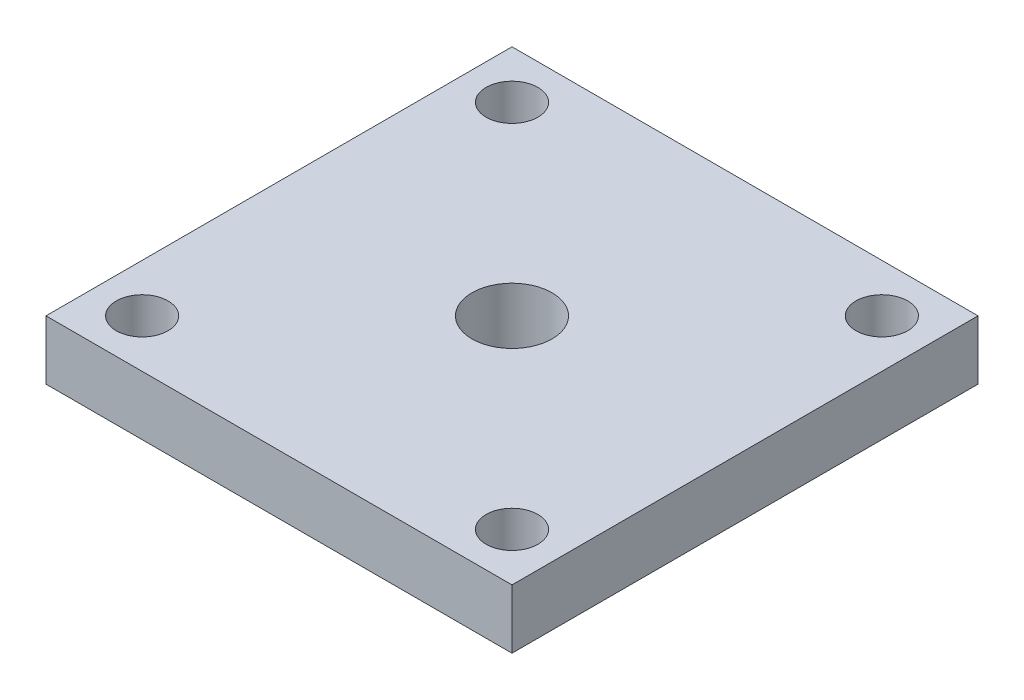
ISO-10303-21;
HEADER;
FILE_DESCRIPTION(('STEP AP214'),'2;1');
FILE_NAME('part.step','',(''),(''),'','','');
FILE_SCHEMA(('AUTOMOTIVE_DESIGN { 1 0 10303 214 1 1 1 1 }'));
ENDSEC;
DATA;
#1=APPLICATION_CONTEXT('core data for automotive mechanical design processes');
#2=APPLICATION_PROTOCOL_DEFINITION('international standard','automotive_design',2000,#1);
#3=PRODUCT_CONTEXT('',#1,'mechanical');
#4=PRODUCT('Part','Part','',(#3));
#5=PRODUCT_RELATED_PRODUCT_CATEGORY('part','',(#4));
#6=PRODUCT_DEFINITION_FORMATION('','',#4);
#7=PRODUCT_DEFINITION_CONTEXT('part definition',#1,'design');
#8=PRODUCT_DEFINITION('design','',#6,#7);
#9=PRODUCT_DEFINITION_SHAPE('','',#8);
#10=(LENGTH_UNIT() NAMED_UNIT(*) SI_UNIT(.MILLI.,.METRE.));
#11=(NAMED_UNIT(*) PLANE_ANGLE_UNIT() SI_UNIT($,.RADIAN.));
#12=(NAMED_UNIT(*) SI_UNIT($,.STERADIAN.) SOLID_ANGLE_UNIT());
#13=UNCERTAINTY_MEASURE_WITH_UNIT(LENGTH_MEASURE(1.E-05),#10,'distance_accuracy_value','');
#14=(GEOMETRIC_REPRESENTATION_CONTEXT(3) GLOBAL_UNCERTAINTY_ASSIGNED_CONTEXT((#13)) GLOBAL_UNIT_ASSIGNED_CONTEXT((#10,
#11,#12)) REPRESENTATION_CONTEXT('',''));
#15=CARTESIAN_POINT('',(0.,0.,0.));
#16=DIRECTION('',(0.,0.,1.));
#17=DIRECTION('',(1.,0.,0.));
#18=AXIS2_PLACEMENT_3D('',#15,#16,#17);
#19=CARTESIAN_POINT('',(15.75,4.,15.75));
#20=DIRECTION('',(-1.,0.,0.));
#21=DIRECTION('',(0.,0.,1.));
#22=AXIS2_PLACEMENT_3D('',#19,#20,#21);
#23=PLANE('',#22);
#24=DIRECTION('',(0.,0.,-1.));
#25=VECTOR('',#24,1.);
#26=CARTESIAN_POINT('',(15.75,0.,15.75));
#27=LINE('',#26,#25);
#28=CARTESIAN_POINT('',(15.75,0.,15.75));
#29=VERTEX_POINT('',#28);
#30=CARTESIAN_POINT('',(15.75,0.,-15.75));
#31=VERTEX_POINT('',#30);
#32=EDGE_CURVE('E99',#29,#31,#27,.T.);
#33=ORIENTED_EDGE('',*,*,#32,.T.);
#34=DIRECTION('',(0.,-1.,0.));
#35=VECTOR('',#34,1.);
#36=CARTESIAN_POINT('',(15.75,4.,-15.75));
#37=LINE('',#36,#35);
#38=CARTESIAN_POINT('',(15.75,4.,-15.75));
#39=VERTEX_POINT('',#38);
#40=EDGE_CURVE('E11',#39,#31,#37,.T.);
#41=ORIENTED_EDGE('',*,*,#40,.F.);
#42=DIRECTION('',(0.,0.,-1.));
#43=VECTOR('',#42,1.);
#44=CARTESIAN_POINT('',(15.75,4.,15.75));
#45=LINE('',#44,#43);
#46=CARTESIAN_POINT('',(15.75,4.,15.75));
#47=VERTEX_POINT('',#46);
#48=EDGE_CURVE('E87',#47,#39,#45,.T.);
#49=ORIENTED_EDGE('',*,*,#48,.F.);
#50=DIRECTION('',(0.,-1.,0.));
#51=VECTOR('',#50,1.);
#52=CARTESIAN_POINT('',(15.75,4.,15.75));
#53=LINE('',#52,#51);
#54=EDGE_CURVE('E95',#47,#29,#53,.T.);
#55=ORIENTED_EDGE('',*,*,#54,.T.);
#56=EDGE_LOOP('',(#33,#41,#49,#55));
#57=FACE_BOUND('',#56,.T.);
#58=ADVANCED_FACE('F36',(#57),#23,.F.);
#59=CARTESIAN_POINT('',(-15.75,4.,-15.75));
#60=DIRECTION('',(0.,0.,1.));
#61=DIRECTION('',(1.,0.,0.));
#62=AXIS2_PLACEMENT_3D('',#59,#60,#61);
#63=PLANE('',#62);
#64=DIRECTION('',(-1.,0.,0.));
#65=VECTOR('',#64,1.);
#66=CARTESIAN_POINT('',(-15.75,0.,-15.75));
#67=LINE('',#66,#65);
#68=CARTESIAN_POINT('',(-15.75,0.,-15.75));
#69=VERTEX_POINT('',#68);
#70=EDGE_CURVE('E91',#31,#69,#67,.T.);
#71=ORIENTED_EDGE('',*,*,#70,.T.);
#72=DIRECTION('',(0.,-1.,0.));
#73=VECTOR('',#72,1.);
#74=CARTESIAN_POINT('',(-15.75,4.,-15.75));
#75=LINE('',#74,#73);
#76=CARTESIAN_POINT('',(-15.75,4.,-15.75));
#77=VERTEX_POINT('',#76);
#78=EDGE_CURVE('E44',#77,#69,#75,.T.);
#79=ORIENTED_EDGE('',*,*,#78,.F.);
#80=DIRECTION('',(-1.,0.,0.));
#81=VECTOR('',#80,1.);
#82=CARTESIAN_POINT('',(-15.75,4.,-15.75));
#83=LINE('',#82,#81);
#84=EDGE_CURVE('E82',#39,#77,#83,.T.);
#85=ORIENTED_EDGE('',*,*,#84,.F.);
#86=ORIENTED_EDGE('',*,*,#40,.T.);
#87=EDGE_LOOP('',(#71,#79,#85,#86));
#88=FACE_BOUND('',#87,.T.);
#89=ADVANCED_FACE('F90',(#88),#63,.F.);
#90=CARTESIAN_POINT('',(-15.75,4.,15.75));
#91=DIRECTION('',(1.,0.,0.));
#92=DIRECTION('',(0.,0.,-1.));
#93=AXIS2_PLACEMENT_3D('',#90,#91,#92);
#94=PLANE('',#93);
#95=DIRECTION('',(0.,0.,1.));
#96=VECTOR('',#95,1.);
#97=CARTESIAN_POINT('',(-15.75,0.,15.75));
#98=LINE('',#97,#96);
#99=CARTESIAN_POINT('',(-15.75,0.,15.75));
#100=VERTEX_POINT('',#99);
#101=EDGE_CURVE('E69',#69,#100,#98,.T.);
#102=ORIENTED_EDGE('',*,*,#101,.T.);
#103=DIRECTION('',(0.,-1.,0.));
#104=VECTOR('',#103,1.);
#105=CARTESIAN_POINT('',(-15.75,4.,15.75));
#106=LINE('',#105,#104);
#107=CARTESIAN_POINT('',(-15.75,4.,15.75));
#108=VERTEX_POINT('',#107);
#109=EDGE_CURVE('E92',#108,#100,#106,.T.);
#110=ORIENTED_EDGE('',*,*,#109,.F.);
#111=DIRECTION('',(0.,0.,1.));
#112=VECTOR('',#111,1.);
#113=CARTESIAN_POINT('',(-15.75,4.,15.75));
#114=LINE('',#113,#112);
#115=EDGE_CURVE('E85',#77,#108,#114,.T.);
#116=ORIENTED_EDGE('',*,*,#115,.F.);
#117=ORIENTED_EDGE('',*,*,#78,.T.);
#118=EDGE_LOOP('',(#102,#110,#116,#117));
#119=FACE_BOUND('',#118,.T.);
#120=ADVANCED_FACE('F93',(#119),#94,.F.);
#121=CARTESIAN_POINT('',(-15.75,4.,15.75));
#122=DIRECTION('',(0.,0.,-1.));
#123=DIRECTION('',(-1.,0.,0.));
#124=AXIS2_PLACEMENT_3D('',#121,#122,#123);
#125=PLANE('',#124);
#126=DIRECTION('',(1.,0.,0.));
#127=VECTOR('',#126,1.);
#128=CARTESIAN_POINT('',(-15.75,0.,15.75));
#129=LINE('',#128,#127);
#130=EDGE_CURVE('E75',#100,#29,#129,.T.);
#131=ORIENTED_EDGE('',*,*,#130,.T.);
#132=ORIENTED_EDGE('',*,*,#54,.F.);
#133=DIRECTION('',(1.,0.,0.));
#134=VECTOR('',#133,1.);
#135=CARTESIAN_POINT('',(-15.75,4.,15.75));
#136=LINE('',#135,#134);
#137=EDGE_CURVE('E52',#108,#47,#136,.T.);
#138=ORIENTED_EDGE('',*,*,#137,.F.);
#139=ORIENTED_EDGE('',*,*,#109,.T.);
#140=EDGE_LOOP('',(#131,#132,#138,#139));
#141=FACE_BOUND('',#140,.T.);
#142=ADVANCED_FACE('F107',(#141),#125,.F.);
#143=CARTESIAN_POINT('',(0.,4.,0.));
#144=DIRECTION('',(0.,-1.,0.));
#145=DIRECTION('',(0.,0.,-1.));
#146=AXIS2_PLACEMENT_3D('',#143,#144,#145);
#147=PLANE('',#146);
#148=CARTESIAN_POINT('',(0.,4.,0.));
#149=DIRECTION('',(0.,1.,0.));
#150=DIRECTION('',(0.,0.,1.));
#151=AXIS2_PLACEMENT_3D('',#148,#149,#150);
#152=CIRCLE('',#151,2.7051);
#153=CARTESIAN_POINT('',(0.,4.,2.7051));
#154=VERTEX_POINT('',#153);
#155=EDGE_CURVE('E139',#154,#154,#152,.T.);
#156=ORIENTED_EDGE('',*,*,#155,.F.);
#157=EDGE_LOOP('',(#156));
#158=FACE_BOUND('',#157,.T.);
#159=CARTESIAN_POINT('',(-12.5,4.,-12.5));
#160=DIRECTION('',(0.,1.,0.));
#161=DIRECTION('',(0.,0.,1.));
#162=AXIS2_PLACEMENT_3D('',#159,#160,#161);
#163=CIRCLE('',#162,1.74999999999999);
#164=CARTESIAN_POINT('',(-12.5,4.,-10.75));
#165=VERTEX_POINT('',#164);
#166=EDGE_CURVE('E133',#165,#165,#163,.T.);
#167=ORIENTED_EDGE('',*,*,#166,.F.);
#168=EDGE_LOOP('',(#167));
#169=FACE_BOUND('',#168,.T.);
#170=CARTESIAN_POINT('',(12.5,4.,-12.5));
#171=DIRECTION('',(0.,1.,0.));
#172=DIRECTION('',(0.,0.,1.));
#173=AXIS2_PLACEMENT_3D('',#170,#171,#172);
#174=CIRCLE('',#173,1.74999999999999);
#175=CARTESIAN_POINT('',(12.5,4.,-10.75));
#176=VERTEX_POINT('',#175);
#177=EDGE_CURVE('E127',#176,#176,#174,.T.);
#178=ORIENTED_EDGE('',*,*,#177,.F.);
#179=EDGE_LOOP('',(#178));
#180=FACE_BOUND('',#179,.T.);
#181=CARTESIAN_POINT('',(12.5,4.,12.5));
#182=DIRECTION('',(0.,1.,0.));
#183=DIRECTION('',(0.,0.,1.));
#184=AXIS2_PLACEMENT_3D('',#181,#182,#183);
#185=CIRCLE('',#184,1.74999999999999);
#186=CARTESIAN_POINT('',(12.5,4.,14.25));
#187=VERTEX_POINT('',#186);
#188=EDGE_CURVE('E121',#187,#187,#185,.T.);
#189=ORIENTED_EDGE('',*,*,#188,.F.);
#190=EDGE_LOOP('',(#189));
#191=FACE_BOUND('',#190,.T.);
#192=CARTESIAN_POINT('',(-12.5,4.,12.5));
#193=DIRECTION('',(0.,1.,0.));
#194=DIRECTION('',(0.,0.,1.));
#195=AXIS2_PLACEMENT_3D('',#192,#193,#194);
#196=CIRCLE('',#195,1.74999999999999);
#197=CARTESIAN_POINT('',(-12.5,4.,14.25));
#198=VERTEX_POINT('',#197);
#199=EDGE_CURVE('E115',#198,#198,#196,.T.);
#200=ORIENTED_EDGE('',*,*,#199,.F.);
#201=EDGE_LOOP('',(#200));
#202=FACE_BOUND('',#201,.T.);
#203=ORIENTED_EDGE('',*,*,#48,.T.);
#204=ORIENTED_EDGE('',*,*,#84,.T.);
#205=ORIENTED_EDGE('',*,*,#115,.T.);
#206=ORIENTED_EDGE('',*,*,#137,.T.);
#207=EDGE_LOOP('',(#203,#204,#205,#206));
#208=FACE_BOUND('',#207,.T.);
#209=ADVANCED_FACE('F83',(#158,#169,#180,#191,#202,#208),#147,.F.);
#210=CARTESIAN_POINT('',(0.,0.,0.));
#211=DIRECTION('',(0.,-1.,0.));
#212=DIRECTION('',(0.,0.,-1.));
#213=AXIS2_PLACEMENT_3D('',#210,#211,#212);
#214=PLANE('',#213);
#215=CARTESIAN_POINT('',(0.,0.,0.));
#216=DIRECTION('',(0.,1.,0.));
#217=DIRECTION('',(0.,0.,1.));
#218=AXIS2_PLACEMENT_3D('',#215,#216,#217);
#219=CIRCLE('',#218,2.7051);
#220=CARTESIAN_POINT('',(0.,0.,2.7051));
#221=VERTEX_POINT('',#220);
#222=EDGE_CURVE('E136',#221,#221,#219,.T.);
#223=ORIENTED_EDGE('',*,*,#222,.T.);
#224=EDGE_LOOP('',(#223));
#225=FACE_BOUND('',#224,.T.);
#226=CARTESIAN_POINT('',(-12.5,0.,-12.5));
#227=DIRECTION('',(0.,1.,0.));
#228=DIRECTION('',(0.,0.,1.));
#229=AXIS2_PLACEMENT_3D('',#226,#227,#228);
#230=CIRCLE('',#229,1.75);
#231=CARTESIAN_POINT('',(-12.5,0.,-10.75));
#232=VERTEX_POINT('',#231);
#233=EDGE_CURVE('E130',#232,#232,#230,.T.);
#234=ORIENTED_EDGE('',*,*,#233,.T.);
#235=EDGE_LOOP('',(#234));
#236=FACE_BOUND('',#235,.T.);
#237=CARTESIAN_POINT('',(12.5,0.,-12.5));
#238=DIRECTION('',(0.,1.,0.));
#239=DIRECTION('',(0.,0.,1.));
#240=AXIS2_PLACEMENT_3D('',#237,#238,#239);
#241=CIRCLE('',#240,1.75);
#242=CARTESIAN_POINT('',(12.5,0.,-10.75));
#243=VERTEX_POINT('',#242);
#244=EDGE_CURVE('E124',#243,#243,#241,.T.);
#245=ORIENTED_EDGE('',*,*,#244,.T.);
#246=EDGE_LOOP('',(#245));
#247=FACE_BOUND('',#246,.T.);
#248=CARTESIAN_POINT('',(12.5,0.,12.5));
#249=DIRECTION('',(0.,1.,0.));
#250=DIRECTION('',(0.,0.,1.));
#251=AXIS2_PLACEMENT_3D('',#248,#249,#250);
#252=CIRCLE('',#251,1.75);
#253=CARTESIAN_POINT('',(12.5,0.,14.25));
#254=VERTEX_POINT('',#253);
#255=EDGE_CURVE('E118',#254,#254,#252,.T.);
#256=ORIENTED_EDGE('',*,*,#255,.T.);
#257=EDGE_LOOP('',(#256));
#258=FACE_BOUND('',#257,.T.);
#259=CARTESIAN_POINT('',(-12.5,0.,12.5));
#260=DIRECTION('',(0.,1.,0.));
#261=DIRECTION('',(0.,0.,1.));
#262=AXIS2_PLACEMENT_3D('',#259,#260,#261);
#263=CIRCLE('',#262,1.75);
#264=CARTESIAN_POINT('',(-12.5,0.,14.25));
#265=VERTEX_POINT('',#264);
#266=EDGE_CURVE('E102',#265,#265,#263,.T.);
#267=ORIENTED_EDGE('',*,*,#266,.T.);
#268=EDGE_LOOP('',(#267));
#269=FACE_BOUND('',#268,.T.);
#270=ORIENTED_EDGE('',*,*,#32,.F.);
#271=ORIENTED_EDGE('',*,*,#130,.F.);
#272=ORIENTED_EDGE('',*,*,#101,.F.);
#273=ORIENTED_EDGE('',*,*,#70,.F.);
#274=EDGE_LOOP('',(#270,#271,#272,#273));
#275=FACE_BOUND('',#274,.T.);
#276=ADVANCED_FACE('F110',(#225,#236,#247,#258,#269,#275),#214,.T.);
#277=CARTESIAN_POINT('',(-12.5,4.,12.5));
#278=DIRECTION('',(0.,1.,0.));
#279=DIRECTION('',(0.,0.,1.));
#280=AXIS2_PLACEMENT_3D('',#277,#278,#279);
#281=CYLINDRICAL_SURFACE('',#280,1.74999999999999);
#282=ORIENTED_EDGE('',*,*,#266,.F.);
#283=EDGE_LOOP('',(#282));
#284=FACE_BOUND('',#283,.T.);
#285=ORIENTED_EDGE('',*,*,#199,.T.);
#286=EDGE_LOOP('',(#285));
#287=FACE_BOUND('',#286,.T.);
#288=ADVANCED_FACE('F156',(#284,#287),#281,.F.);
#289=CARTESIAN_POINT('',(12.5,4.,12.5));
#290=DIRECTION('',(0.,1.,0.));
#291=DIRECTION('',(0.,0.,1.));
#292=AXIS2_PLACEMENT_3D('',#289,#290,#291);
#293=CYLINDRICAL_SURFACE('',#292,1.74999999999999);
#294=ORIENTED_EDGE('',*,*,#255,.F.);
#295=EDGE_LOOP('',(#294));
#296=FACE_BOUND('',#295,.T.);
#297=ORIENTED_EDGE('',*,*,#188,.T.);
#298=EDGE_LOOP('',(#297));
#299=FACE_BOUND('',#298,.T.);
#300=ADVANCED_FACE('F158',(#296,#299),#293,.F.);
#301=CARTESIAN_POINT('',(12.5,4.,-12.5));
#302=DIRECTION('',(0.,1.,0.));
#303=DIRECTION('',(0.,0.,1.));
#304=AXIS2_PLACEMENT_3D('',#301,#302,#303);
#305=CYLINDRICAL_SURFACE('',#304,1.74999999999999);
#306=ORIENTED_EDGE('',*,*,#244,.F.);
#307=EDGE_LOOP('',(#306));
#308=FACE_BOUND('',#307,.T.);
#309=ORIENTED_EDGE('',*,*,#177,.T.);
#310=EDGE_LOOP('',(#309));
#311=FACE_BOUND('',#310,.T.);
#312=ADVANCED_FACE('F165',(#308,#311),#305,.F.);
#313=CARTESIAN_POINT('',(-12.5,4.,-12.5));
#314=DIRECTION('',(0.,1.,0.));
#315=DIRECTION('',(0.,0.,1.));
#316=AXIS2_PLACEMENT_3D('',#313,#314,#315);
#317=CYLINDRICAL_SURFACE('',#316,1.74999999999999);
#318=ORIENTED_EDGE('',*,*,#233,.F.);
#319=EDGE_LOOP('',(#318));
#320=FACE_BOUND('',#319,.T.);
#321=ORIENTED_EDGE('',*,*,#166,.T.);
#322=EDGE_LOOP('',(#321));
#323=FACE_BOUND('',#322,.T.);
#324=ADVANCED_FACE('F207',(#320,#323),#317,.F.);
#325=CARTESIAN_POINT('',(0.,4.,0.));
#326=DIRECTION('',(0.,1.,0.));
#327=DIRECTION('',(0.,0.,1.));
#328=AXIS2_PLACEMENT_3D('',#325,#326,#327);
#329=CYLINDRICAL_SURFACE('',#328,2.7051);
#330=ORIENTED_EDGE('',*,*,#222,.F.);
#331=EDGE_LOOP('',(#330));
#332=FACE_BOUND('',#331,.T.);
#333=ORIENTED_EDGE('',*,*,#155,.T.);
#334=EDGE_LOOP('',(#333));
#335=FACE_BOUND('',#334,.T.);
#336=ADVANCED_FACE('F143',(#332,#335),#329,.F.);
#337=CLOSED_SHELL('',(#58,#89,#120,#142,#209,#276,#288,#300,#312,#324,#336));
#338=MANIFOLD_SOLID_BREP('B2',#337);
#339=ADVANCED_BREP_SHAPE_REPRESENTATION('',(#18,#338),#14);
#340=SHAPE_DEFINITION_REPRESENTATION(#9,#339);
ENDSEC;
END-ISO-10303-21;
